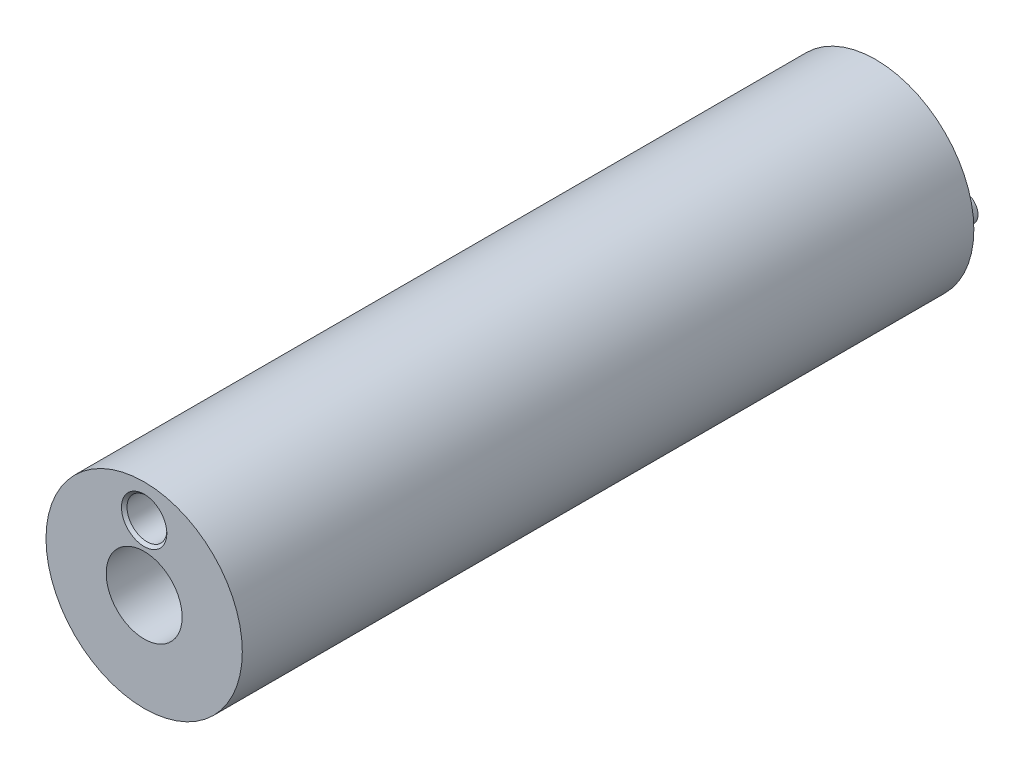
ISO-10303-21;
HEADER;
FILE_DESCRIPTION(('STEP AP214'),'2;1');
FILE_NAME('part.step','',(''),(''),'','','');
FILE_SCHEMA(('AUTOMOTIVE_DESIGN { 1 0 10303 214 1 1 1 1 }'));
ENDSEC;
DATA;
#1=APPLICATION_CONTEXT('core data for automotive mechanical design processes');
#2=APPLICATION_PROTOCOL_DEFINITION('international standard','automotive_design',2000,#1);
#3=PRODUCT_CONTEXT('',#1,'mechanical');
#4=PRODUCT('Part','Part','',(#3));
#5=PRODUCT_RELATED_PRODUCT_CATEGORY('part','',(#4));
#6=PRODUCT_DEFINITION_FORMATION('','',#4);
#7=PRODUCT_DEFINITION_CONTEXT('part definition',#1,'design');
#8=PRODUCT_DEFINITION('design','',#6,#7);
#9=PRODUCT_DEFINITION_SHAPE('','',#8);
#10=(LENGTH_UNIT() NAMED_UNIT(*) SI_UNIT(.MILLI.,.METRE.));
#11=(NAMED_UNIT(*) PLANE_ANGLE_UNIT() SI_UNIT($,.RADIAN.));
#12=(NAMED_UNIT(*) SI_UNIT($,.STERADIAN.) SOLID_ANGLE_UNIT());
#13=UNCERTAINTY_MEASURE_WITH_UNIT(LENGTH_MEASURE(1.E-05),#10,'distance_accuracy_value','');
#14=(GEOMETRIC_REPRESENTATION_CONTEXT(3) GLOBAL_UNCERTAINTY_ASSIGNED_CONTEXT((#13)) GLOBAL_UNIT_ASSIGNED_CONTEXT((#10,
#11,#12)) REPRESENTATION_CONTEXT('',''));
#15=CARTESIAN_POINT('',(0.,0.,0.));
#16=DIRECTION('',(0.,0.,1.));
#17=DIRECTION('',(1.,0.,0.));
#18=AXIS2_PLACEMENT_3D('',#15,#16,#17);
#19=CARTESIAN_POINT('',(0.,0.,79.));
#20=DIRECTION('',(0.,0.,1.));
#21=DIRECTION('',(1.,0.,0.));
#22=AXIS2_PLACEMENT_3D('',#19,#20,#21);
#23=PLANE('',#22);
#24=CARTESIAN_POINT('',(0.,7.,79.));
#25=DIRECTION('',(0.,0.,1.));
#26=DIRECTION('',(1.,0.,0.));
#27=AXIS2_PLACEMENT_3D('',#24,#25,#26);
#28=CIRCLE('',#27,2.45000000000001);
#29=CARTESIAN_POINT('',(2.45000000000001,7.,79.));
#30=VERTEX_POINT('',#29);
#31=EDGE_CURVE('E48',#30,#30,#28,.F.);
#32=ORIENTED_EDGE('',*,*,#31,.T.);
#33=EDGE_LOOP('',(#32));
#34=FACE_BOUND('',#33,.T.);
#35=CARTESIAN_POINT('',(0.,0.,79.));
#36=DIRECTION('',(0.,0.,1.));
#37=DIRECTION('',(1.,0.,0.));
#38=AXIS2_PLACEMENT_3D('',#35,#36,#37);
#39=CIRCLE('',#38,10.6);
#40=CARTESIAN_POINT('',(10.6,0.,79.));
#41=VERTEX_POINT('',#40);
#42=EDGE_CURVE('E64',#41,#41,#39,.T.);
#43=ORIENTED_EDGE('',*,*,#42,.T.);
#44=EDGE_LOOP('',(#43));
#45=FACE_BOUND('',#44,.T.);
#46=CARTESIAN_POINT('',(0.,0.,79.));
#47=DIRECTION('',(0.,0.,1.));
#48=DIRECTION('',(1.,0.,0.));
#49=AXIS2_PLACEMENT_3D('',#46,#47,#48);
#50=CIRCLE('',#49,4.1);
#51=CARTESIAN_POINT('',(4.1,0.,79.));
#52=VERTEX_POINT('',#51);
#53=EDGE_CURVE('E69',#52,#52,#50,.T.);
#54=ORIENTED_EDGE('',*,*,#53,.F.);
#55=EDGE_LOOP('',(#54));
#56=FACE_BOUND('',#55,.T.);
#57=ADVANCED_FACE('F39',(#34,#45,#56),#23,.T.);
#58=CARTESIAN_POINT('',(0.,0.,0.));
#59=DIRECTION('',(0.,0.,1.));
#60=DIRECTION('',(1.,0.,0.));
#61=AXIS2_PLACEMENT_3D('',#58,#59,#60);
#62=PLANE('',#61);
#63=CARTESIAN_POINT('',(0.,7.,0.));
#64=DIRECTION('',(0.,0.,1.));
#65=DIRECTION('',(1.,0.,0.));
#66=AXIS2_PLACEMENT_3D('',#63,#64,#65);
#67=CIRCLE('',#66,2.45000000000001);
#68=CARTESIAN_POINT('',(2.45000000000001,7.,0.));
#69=VERTEX_POINT('',#68);
#70=EDGE_CURVE('E10',#69,#69,#67,.T.);
#71=ORIENTED_EDGE('',*,*,#70,.T.);
#72=EDGE_LOOP('',(#71));
#73=FACE_BOUND('',#72,.T.);
#74=CARTESIAN_POINT('',(8.,0.,0.));
#75=DIRECTION('',(0.,0.,1.));
#76=DIRECTION('',(-1.,0.,0.));
#77=AXIS2_PLACEMENT_3D('',#74,#75,#76);
#78=CIRCLE('',#77,1.45);
#79=CARTESIAN_POINT('',(6.55,0.,0.));
#80=VERTEX_POINT('',#79);
#81=EDGE_CURVE('E89',#80,#80,#78,.T.);
#82=ORIENTED_EDGE('',*,*,#81,.T.);
#83=EDGE_LOOP('',(#82));
#84=FACE_BOUND('',#83,.T.);
#85=CARTESIAN_POINT('',(-8.,0.,0.));
#86=DIRECTION('',(0.,0.,1.));
#87=DIRECTION('',(1.,0.,0.));
#88=AXIS2_PLACEMENT_3D('',#85,#86,#87);
#89=CIRCLE('',#88,1.45);
#90=CARTESIAN_POINT('',(-6.55,0.,0.));
#91=VERTEX_POINT('',#90);
#92=EDGE_CURVE('E81',#91,#91,#89,.T.);
#93=ORIENTED_EDGE('',*,*,#92,.T.);
#94=EDGE_LOOP('',(#93));
#95=FACE_BOUND('',#94,.T.);
#96=CARTESIAN_POINT('',(0.,0.,0.));
#97=DIRECTION('',(0.,0.,1.));
#98=DIRECTION('',(1.,0.,0.));
#99=AXIS2_PLACEMENT_3D('',#96,#97,#98);
#100=CIRCLE('',#99,10.6);
#101=CARTESIAN_POINT('',(10.6,0.,0.));
#102=VERTEX_POINT('',#101);
#103=EDGE_CURVE('E65',#102,#102,#100,.T.);
#104=ORIENTED_EDGE('',*,*,#103,.F.);
#105=EDGE_LOOP('',(#104));
#106=FACE_BOUND('',#105,.T.);
#107=CARTESIAN_POINT('',(0.,0.,0.));
#108=DIRECTION('',(0.,0.,1.));
#109=DIRECTION('',(1.,0.,0.));
#110=AXIS2_PLACEMENT_3D('',#107,#108,#109);
#111=CIRCLE('',#110,4.1);
#112=CARTESIAN_POINT('',(4.1,0.,0.));
#113=VERTEX_POINT('',#112);
#114=EDGE_CURVE('E73',#113,#113,#111,.T.);
#115=ORIENTED_EDGE('',*,*,#114,.T.);
#116=EDGE_LOOP('',(#115));
#117=FACE_BOUND('',#116,.T.);
#118=ADVANCED_FACE('F112',(#73,#84,#95,#106,#117),#62,.F.);
#119=CARTESIAN_POINT('',(0.,0.,79.));
#120=DIRECTION('',(0.,0.,-1.));
#121=DIRECTION('',(-1.,0.,0.));
#122=AXIS2_PLACEMENT_3D('',#119,#120,#121);
#123=CYLINDRICAL_SURFACE('',#122,10.6);
#124=ORIENTED_EDGE('',*,*,#42,.F.);
#125=EDGE_LOOP('',(#124));
#126=FACE_BOUND('',#125,.T.);
#127=ORIENTED_EDGE('',*,*,#103,.T.);
#128=EDGE_LOOP('',(#127));
#129=FACE_BOUND('',#128,.T.);
#130=ADVANCED_FACE('F117',(#126,#129),#123,.T.);
#131=CARTESIAN_POINT('',(0.,7.,79.));
#132=DIRECTION('',(0.,0.,-1.));
#133=DIRECTION('',(-1.,0.,0.));
#134=AXIS2_PLACEMENT_3D('',#131,#132,#133);
#135=CYLINDRICAL_SURFACE('',#134,2.15);
#136=CARTESIAN_POINT('',(0.,7.,78.7));
#137=DIRECTION('',(0.,0.,1.));
#138=DIRECTION('',(1.,0.,0.));
#139=AXIS2_PLACEMENT_3D('',#136,#137,#138);
#140=CIRCLE('',#139,2.15);
#141=CARTESIAN_POINT('',(2.15,7.,78.7));
#142=VERTEX_POINT('',#141);
#143=EDGE_CURVE('E53',#142,#142,#140,.T.);
#144=ORIENTED_EDGE('',*,*,#143,.T.);
#145=EDGE_LOOP('',(#144));
#146=FACE_BOUND('',#145,.T.);
#147=CARTESIAN_POINT('',(0.,7.,0.300000000000009));
#148=DIRECTION('',(0.,0.,1.));
#149=DIRECTION('',(1.,0.,0.));
#150=AXIS2_PLACEMENT_3D('',#147,#148,#149);
#151=CIRCLE('',#150,2.15);
#152=CARTESIAN_POINT('',(2.15,7.,0.300000000000009));
#153=VERTEX_POINT('',#152);
#154=EDGE_CURVE('E58',#153,#153,#151,.F.);
#155=ORIENTED_EDGE('',*,*,#154,.T.);
#156=EDGE_LOOP('',(#155));
#157=FACE_BOUND('',#156,.T.);
#158=ADVANCED_FACE('F121',(#146,#157),#135,.F.);
#159=CARTESIAN_POINT('',(0.,0.,79.));
#160=DIRECTION('',(0.,0.,-1.));
#161=DIRECTION('',(-1.,0.,0.));
#162=AXIS2_PLACEMENT_3D('',#159,#160,#161);
#163=CYLINDRICAL_SURFACE('',#162,4.1);
#164=ORIENTED_EDGE('',*,*,#53,.T.);
#165=EDGE_LOOP('',(#164));
#166=FACE_BOUND('',#165,.T.);
#167=ORIENTED_EDGE('',*,*,#114,.F.);
#168=EDGE_LOOP('',(#167));
#169=FACE_BOUND('',#168,.T.);
#170=ADVANCED_FACE('F134',(#166,#169),#163,.F.);
#171=CARTESIAN_POINT('',(-8.,0.,-1.6));
#172=DIRECTION('',(0.,0.,1.));
#173=DIRECTION('',(1.,0.,0.));
#174=AXIS2_PLACEMENT_3D('',#171,#172,#173);
#175=CYLINDRICAL_SURFACE('',#174,1.45);
#176=CARTESIAN_POINT('',(-8.,0.,-1.6));
#177=DIRECTION('',(0.,0.,1.));
#178=DIRECTION('',(1.,0.,0.));
#179=AXIS2_PLACEMENT_3D('',#176,#177,#178);
#180=CIRCLE('',#179,1.45);
#181=CARTESIAN_POINT('',(-6.55,0.,-1.6));
#182=VERTEX_POINT('',#181);
#183=EDGE_CURVE('E77',#182,#182,#180,.T.);
#184=ORIENTED_EDGE('',*,*,#183,.T.);
#185=EDGE_LOOP('',(#184));
#186=FACE_BOUND('',#185,.T.);
#187=ORIENTED_EDGE('',*,*,#92,.F.);
#188=EDGE_LOOP('',(#187));
#189=FACE_BOUND('',#188,.T.);
#190=ADVANCED_FACE('F144',(#186,#189),#175,.T.);
#191=CARTESIAN_POINT('',(-8.,0.,-1.6));
#192=DIRECTION('',(0.,0.,1.));
#193=DIRECTION('',(1.,0.,0.));
#194=AXIS2_PLACEMENT_3D('',#191,#192,#193);
#195=PLANE('',#194);
#196=ORIENTED_EDGE('',*,*,#183,.F.);
#197=EDGE_LOOP('',(#196));
#198=FACE_BOUND('',#197,.T.);
#199=ADVANCED_FACE('F109',(#198),#195,.F.);
#200=CARTESIAN_POINT('',(8.,0.,-1.6));
#201=DIRECTION('',(0.,0.,1.));
#202=DIRECTION('',(1.,0.,0.));
#203=AXIS2_PLACEMENT_3D('',#200,#201,#202);
#204=CYLINDRICAL_SURFACE('',#203,1.45);
#205=CARTESIAN_POINT('',(8.,0.,-1.6));
#206=DIRECTION('',(0.,0.,1.));
#207=DIRECTION('',(-1.,0.,0.));
#208=AXIS2_PLACEMENT_3D('',#205,#206,#207);
#209=CIRCLE('',#208,1.45);
#210=CARTESIAN_POINT('',(6.55,0.,-1.6));
#211=VERTEX_POINT('',#210);
#212=EDGE_CURVE('E85',#211,#211,#209,.T.);
#213=ORIENTED_EDGE('',*,*,#212,.T.);
#214=EDGE_LOOP('',(#213));
#215=FACE_BOUND('',#214,.T.);
#216=ORIENTED_EDGE('',*,*,#81,.F.);
#217=EDGE_LOOP('',(#216));
#218=FACE_BOUND('',#217,.T.);
#219=ADVANCED_FACE('F97',(#215,#218),#204,.T.);
#220=CARTESIAN_POINT('',(8.,0.,-1.6));
#221=DIRECTION('',(0.,0.,-1.));
#222=DIRECTION('',(-1.,0.,0.));
#223=AXIS2_PLACEMENT_3D('',#220,#221,#222);
#224=PLANE('',#223);
#225=ORIENTED_EDGE('',*,*,#212,.F.);
#226=EDGE_LOOP('',(#225));
#227=FACE_BOUND('',#226,.T.);
#228=ADVANCED_FACE('F100',(#227),#224,.T.);
#229=CARTESIAN_POINT('',(0.,7.,78.7));
#230=DIRECTION('',(0.,0.,1.));
#231=DIRECTION('',(1.,0.,0.));
#232=AXIS2_PLACEMENT_3D('',#229,#230,#231);
#233=CONICAL_SURFACE('',#232,2.15,0.785398163397435);
#234=ORIENTED_EDGE('',*,*,#31,.F.);
#235=EDGE_LOOP('',(#234));
#236=FACE_BOUND('',#235,.T.);
#237=ORIENTED_EDGE('',*,*,#143,.F.);
#238=EDGE_LOOP('',(#237));
#239=FACE_BOUND('',#238,.T.);
#240=ADVANCED_FACE('F102',(#236,#239),#233,.F.);
#241=CARTESIAN_POINT('',(0.,7.,0.));
#242=DIRECTION('',(0.,0.,-1.));
#243=DIRECTION('',(-1.,0.,0.));
#244=AXIS2_PLACEMENT_3D('',#241,#242,#243);
#245=CONICAL_SURFACE('',#244,2.45000000000001,0.785398163397447);
#246=ORIENTED_EDGE('',*,*,#154,.F.);
#247=EDGE_LOOP('',(#246));
#248=FACE_BOUND('',#247,.T.);
#249=ORIENTED_EDGE('',*,*,#70,.F.);
#250=EDGE_LOOP('',(#249));
#251=FACE_BOUND('',#250,.T.);
#252=ADVANCED_FACE('F42',(#248,#251),#245,.F.);
#253=CLOSED_SHELL('',(#57,#118,#130,#158,#170,#190,#199,#219,#228,#240,#252));
#254=MANIFOLD_SOLID_BREP('B2',#253);
#255=ADVANCED_BREP_SHAPE_REPRESENTATION('',(#18,#254),#14);
#256=SHAPE_DEFINITION_REPRESENTATION(#9,#255);
ENDSEC;
END-ISO-10303-21;
